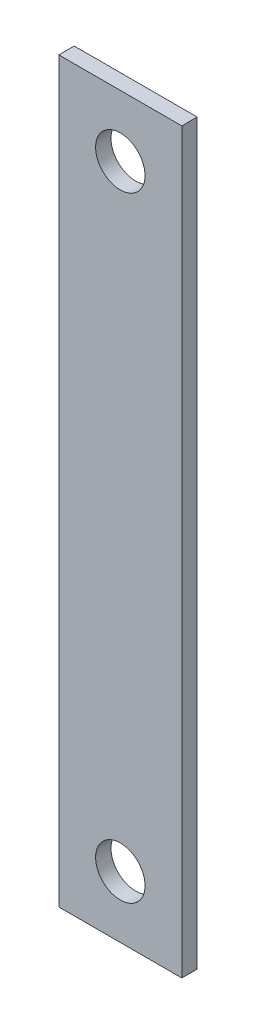
ISO-10303-21;
HEADER;
FILE_DESCRIPTION(('STEP AP214'),'2;1');
FILE_NAME('part.step','',(''),(''),'','','');
FILE_SCHEMA(('AUTOMOTIVE_DESIGN { 1 0 10303 214 1 1 1 1 }'));
ENDSEC;
DATA;
#1=APPLICATION_CONTEXT('core data for automotive mechanical design processes');
#2=APPLICATION_PROTOCOL_DEFINITION('international standard','automotive_design',2000,#1);
#3=PRODUCT_CONTEXT('',#1,'mechanical');
#4=PRODUCT('Part','Part','',(#3));
#5=PRODUCT_RELATED_PRODUCT_CATEGORY('part','',(#4));
#6=PRODUCT_DEFINITION_FORMATION('','',#4);
#7=PRODUCT_DEFINITION_CONTEXT('part definition',#1,'design');
#8=PRODUCT_DEFINITION('design','',#6,#7);
#9=PRODUCT_DEFINITION_SHAPE('','',#8);
#10=(LENGTH_UNIT() NAMED_UNIT(*) SI_UNIT(.MILLI.,.METRE.));
#11=(NAMED_UNIT(*) PLANE_ANGLE_UNIT() SI_UNIT($,.RADIAN.));
#12=(NAMED_UNIT(*) SI_UNIT($,.STERADIAN.) SOLID_ANGLE_UNIT());
#13=UNCERTAINTY_MEASURE_WITH_UNIT(LENGTH_MEASURE(1.E-05),#10,'distance_accuracy_value','');
#14=(GEOMETRIC_REPRESENTATION_CONTEXT(3) GLOBAL_UNCERTAINTY_ASSIGNED_CONTEXT((#13)) GLOBAL_UNIT_ASSIGNED_CONTEXT((#10,
#11,#12)) REPRESENTATION_CONTEXT('',''));
#15=CARTESIAN_POINT('',(0.,0.,0.));
#16=DIRECTION('',(0.,0.,1.));
#17=DIRECTION('',(1.,0.,0.));
#18=AXIS2_PLACEMENT_3D('',#15,#16,#17);
#19=CARTESIAN_POINT('',(0.,0.,-1.5875));
#20=DIRECTION('',(-1.,0.,0.));
#21=DIRECTION('',(0.,-1.,0.));
#22=AXIS2_PLACEMENT_3D('',#19,#20,#21);
#23=PLANE('',#22);
#24=DIRECTION('',(0.,-1.,0.));
#25=VECTOR('',#24,1.);
#26=CARTESIAN_POINT('',(0.,0.,0.));
#27=LINE('',#26,#25);
#28=CARTESIAN_POINT('',(0.,76.2,0.));
#29=VERTEX_POINT('',#28);
#30=CARTESIAN_POINT('',(0.,0.,0.));
#31=VERTEX_POINT('',#30);
#32=EDGE_CURVE('E104',#29,#31,#27,.T.);
#33=ORIENTED_EDGE('',*,*,#32,.F.);
#34=DIRECTION('',(0.,0.,1.));
#35=VECTOR('',#34,1.);
#36=CARTESIAN_POINT('',(0.,76.2,-1.5875));
#37=LINE('',#36,#35);
#38=CARTESIAN_POINT('',(0.,76.2,-1.5875));
#39=VERTEX_POINT('',#38);
#40=EDGE_CURVE('E11',#39,#29,#37,.T.);
#41=ORIENTED_EDGE('',*,*,#40,.F.);
#42=DIRECTION('',(0.,-1.,0.));
#43=VECTOR('',#42,1.);
#44=CARTESIAN_POINT('',(0.,0.,-1.5875));
#45=LINE('',#44,#43);
#46=CARTESIAN_POINT('',(0.,0.,-1.5875));
#47=VERTEX_POINT('',#46);
#48=EDGE_CURVE('E97',#39,#47,#45,.T.);
#49=ORIENTED_EDGE('',*,*,#48,.T.);
#50=DIRECTION('',(0.,0.,1.));
#51=VECTOR('',#50,1.);
#52=CARTESIAN_POINT('',(0.,0.,-1.5875));
#53=LINE('',#52,#51);
#54=EDGE_CURVE('E42',#47,#31,#53,.T.);
#55=ORIENTED_EDGE('',*,*,#54,.T.);
#56=EDGE_LOOP('',(#33,#41,#49,#55));
#57=FACE_BOUND('',#56,.T.);
#58=ADVANCED_FACE('F39',(#57),#23,.T.);
#59=CARTESIAN_POINT('',(0.,76.2,-1.5875));
#60=DIRECTION('',(0.,1.,0.));
#61=DIRECTION('',(0.,0.,1.));
#62=AXIS2_PLACEMENT_3D('',#59,#60,#61);
#63=PLANE('',#62);
#64=DIRECTION('',(-1.,0.,0.));
#65=VECTOR('',#64,1.);
#66=CARTESIAN_POINT('',(0.,76.2,0.));
#67=LINE('',#66,#65);
#68=CARTESIAN_POINT('',(12.7,76.2,0.));
#69=VERTEX_POINT('',#68);
#70=EDGE_CURVE('E99',#69,#29,#67,.T.);
#71=ORIENTED_EDGE('',*,*,#70,.F.);
#72=DIRECTION('',(0.,0.,1.));
#73=VECTOR('',#72,1.);
#74=CARTESIAN_POINT('',(12.7,76.2,-1.5875));
#75=LINE('',#74,#73);
#76=CARTESIAN_POINT('',(12.7,76.2,-1.5875));
#77=VERTEX_POINT('',#76);
#78=EDGE_CURVE('E48',#77,#69,#75,.T.);
#79=ORIENTED_EDGE('',*,*,#78,.F.);
#80=DIRECTION('',(-1.,0.,0.));
#81=VECTOR('',#80,1.);
#82=CARTESIAN_POINT('',(0.,76.2,-1.5875));
#83=LINE('',#82,#81);
#84=EDGE_CURVE('E94',#77,#39,#83,.T.);
#85=ORIENTED_EDGE('',*,*,#84,.T.);
#86=ORIENTED_EDGE('',*,*,#40,.T.);
#87=EDGE_LOOP('',(#71,#79,#85,#86));
#88=FACE_BOUND('',#87,.T.);
#89=ADVANCED_FACE('F115',(#88),#63,.T.);
#90=CARTESIAN_POINT('',(12.7,0.,-1.5875));
#91=DIRECTION('',(1.,0.,0.));
#92=DIRECTION('',(0.,1.,0.));
#93=AXIS2_PLACEMENT_3D('',#90,#91,#92);
#94=PLANE('',#93);
#95=DIRECTION('',(0.,1.,0.));
#96=VECTOR('',#95,1.);
#97=CARTESIAN_POINT('',(12.7,0.,0.));
#98=LINE('',#97,#96);
#99=CARTESIAN_POINT('',(12.7,0.,0.));
#100=VERTEX_POINT('',#99);
#101=EDGE_CURVE('E89',#100,#69,#98,.T.);
#102=ORIENTED_EDGE('',*,*,#101,.F.);
#103=DIRECTION('',(0.,0.,1.));
#104=VECTOR('',#103,1.);
#105=CARTESIAN_POINT('',(12.7,0.,-1.5875));
#106=LINE('',#105,#104);
#107=CARTESIAN_POINT('',(12.7,0.,-1.5875));
#108=VERTEX_POINT('',#107);
#109=EDGE_CURVE('E84',#108,#100,#106,.T.);
#110=ORIENTED_EDGE('',*,*,#109,.F.);
#111=DIRECTION('',(0.,1.,0.));
#112=VECTOR('',#111,1.);
#113=CARTESIAN_POINT('',(12.7,0.,-1.5875));
#114=LINE('',#113,#112);
#115=EDGE_CURVE('E87',#108,#77,#114,.T.);
#116=ORIENTED_EDGE('',*,*,#115,.T.);
#117=ORIENTED_EDGE('',*,*,#78,.T.);
#118=EDGE_LOOP('',(#102,#110,#116,#117));
#119=FACE_BOUND('',#118,.T.);
#120=ADVANCED_FACE('F86',(#119),#94,.T.);
#121=CARTESIAN_POINT('',(0.,0.,-1.5875));
#122=DIRECTION('',(0.,-1.,0.));
#123=DIRECTION('',(0.,0.,-1.));
#124=AXIS2_PLACEMENT_3D('',#121,#122,#123);
#125=PLANE('',#124);
#126=DIRECTION('',(1.,0.,0.));
#127=VECTOR('',#126,1.);
#128=CARTESIAN_POINT('',(0.,0.,0.));
#129=LINE('',#128,#127);
#130=EDGE_CURVE('E107',#31,#100,#129,.T.);
#131=ORIENTED_EDGE('',*,*,#130,.F.);
#132=ORIENTED_EDGE('',*,*,#54,.F.);
#133=DIRECTION('',(1.,0.,0.));
#134=VECTOR('',#133,1.);
#135=CARTESIAN_POINT('',(0.,0.,-1.5875));
#136=LINE('',#135,#134);
#137=EDGE_CURVE('E93',#47,#108,#136,.T.);
#138=ORIENTED_EDGE('',*,*,#137,.T.);
#139=ORIENTED_EDGE('',*,*,#109,.T.);
#140=EDGE_LOOP('',(#131,#132,#138,#139));
#141=FACE_BOUND('',#140,.T.);
#142=ADVANCED_FACE('F96',(#141),#125,.T.);
#143=CARTESIAN_POINT('',(0.,0.,-1.5875));
#144=DIRECTION('',(0.,0.,-1.));
#145=DIRECTION('',(-1.,0.,0.));
#146=AXIS2_PLACEMENT_3D('',#143,#144,#145);
#147=PLANE('',#146);
#148=CARTESIAN_POINT('',(6.34999999999999,69.85,-1.5875));
#149=DIRECTION('',(0.,0.,1.));
#150=DIRECTION('',(1.,0.,0.));
#151=AXIS2_PLACEMENT_3D('',#148,#149,#150);
#152=CIRCLE('',#151,2.5527);
#153=CARTESIAN_POINT('',(8.90269999999999,69.85,-1.5875));
#154=VERTEX_POINT('',#153);
#155=EDGE_CURVE('E148',#154,#154,#152,.T.);
#156=ORIENTED_EDGE('',*,*,#155,.T.);
#157=EDGE_LOOP('',(#156));
#158=FACE_BOUND('',#157,.T.);
#159=CARTESIAN_POINT('',(6.34999999999999,6.35,-1.5875));
#160=DIRECTION('',(0.,0.,1.));
#161=DIRECTION('',(1.,0.,0.));
#162=AXIS2_PLACEMENT_3D('',#159,#160,#161);
#163=CIRCLE('',#162,2.5527);
#164=CARTESIAN_POINT('',(8.90269999999999,6.35,-1.5875));
#165=VERTEX_POINT('',#164);
#166=EDGE_CURVE('E108',#165,#165,#163,.T.);
#167=ORIENTED_EDGE('',*,*,#166,.T.);
#168=EDGE_LOOP('',(#167));
#169=FACE_BOUND('',#168,.T.);
#170=ORIENTED_EDGE('',*,*,#48,.F.);
#171=ORIENTED_EDGE('',*,*,#84,.F.);
#172=ORIENTED_EDGE('',*,*,#115,.F.);
#173=ORIENTED_EDGE('',*,*,#137,.F.);
#174=EDGE_LOOP('',(#170,#171,#172,#173));
#175=FACE_BOUND('',#174,.T.);
#176=ADVANCED_FACE('F92',(#158,#169,#175),#147,.T.);
#177=CARTESIAN_POINT('',(0.,0.,0.));
#178=DIRECTION('',(0.,0.,-1.));
#179=DIRECTION('',(-1.,0.,0.));
#180=AXIS2_PLACEMENT_3D('',#177,#178,#179);
#181=PLANE('',#180);
#182=CARTESIAN_POINT('',(6.34999999999999,69.85,0.));
#183=DIRECTION('',(0.,0.,1.));
#184=DIRECTION('',(1.,0.,0.));
#185=AXIS2_PLACEMENT_3D('',#182,#183,#184);
#186=CIRCLE('',#185,2.55269999999999);
#187=CARTESIAN_POINT('',(8.90269999999998,69.85,0.));
#188=VERTEX_POINT('',#187);
#189=EDGE_CURVE('E151',#188,#188,#186,.T.);
#190=ORIENTED_EDGE('',*,*,#189,.F.);
#191=EDGE_LOOP('',(#190));
#192=FACE_BOUND('',#191,.T.);
#193=CARTESIAN_POINT('',(6.34999999999999,6.35,0.));
#194=DIRECTION('',(0.,0.,1.));
#195=DIRECTION('',(1.,0.,0.));
#196=AXIS2_PLACEMENT_3D('',#193,#194,#195);
#197=CIRCLE('',#196,2.55269999999999);
#198=CARTESIAN_POINT('',(8.90269999999997,6.35,0.));
#199=VERTEX_POINT('',#198);
#200=EDGE_CURVE('E153',#199,#199,#197,.T.);
#201=ORIENTED_EDGE('',*,*,#200,.F.);
#202=EDGE_LOOP('',(#201));
#203=FACE_BOUND('',#202,.T.);
#204=ORIENTED_EDGE('',*,*,#32,.T.);
#205=ORIENTED_EDGE('',*,*,#130,.T.);
#206=ORIENTED_EDGE('',*,*,#101,.T.);
#207=ORIENTED_EDGE('',*,*,#70,.T.);
#208=EDGE_LOOP('',(#204,#205,#206,#207));
#209=FACE_BOUND('',#208,.T.);
#210=ADVANCED_FACE('F114',(#192,#203,#209),#181,.F.);
#211=CARTESIAN_POINT('',(6.34999999999999,6.35,0.));
#212=DIRECTION('',(0.,0.,1.));
#213=DIRECTION('',(1.,0.,0.));
#214=AXIS2_PLACEMENT_3D('',#211,#212,#213);
#215=CYLINDRICAL_SURFACE('',#214,2.55269999999999);
#216=ORIENTED_EDGE('',*,*,#166,.F.);
#217=EDGE_LOOP('',(#216));
#218=FACE_BOUND('',#217,.T.);
#219=ORIENTED_EDGE('',*,*,#200,.T.);
#220=EDGE_LOOP('',(#219));
#221=FACE_BOUND('',#220,.T.);
#222=ADVANCED_FACE('F133',(#218,#221),#215,.F.);
#223=CARTESIAN_POINT('',(6.34999999999999,69.85,0.));
#224=DIRECTION('',(0.,0.,1.));
#225=DIRECTION('',(1.,0.,0.));
#226=AXIS2_PLACEMENT_3D('',#223,#224,#225);
#227=CYLINDRICAL_SURFACE('',#226,2.55269999999999);
#228=ORIENTED_EDGE('',*,*,#155,.F.);
#229=EDGE_LOOP('',(#228));
#230=FACE_BOUND('',#229,.T.);
#231=ORIENTED_EDGE('',*,*,#189,.T.);
#232=EDGE_LOOP('',(#231));
#233=FACE_BOUND('',#232,.T.);
#234=ADVANCED_FACE('F140',(#230,#233),#227,.F.);
#235=CLOSED_SHELL('',(#58,#89,#120,#142,#176,#210,#222,#234));
#236=MANIFOLD_SOLID_BREP('B2',#235);
#237=ADVANCED_BREP_SHAPE_REPRESENTATION('',(#18,#236),#14);
#238=SHAPE_DEFINITION_REPRESENTATION(#9,#237);
ENDSEC;
END-ISO-10303-21;
